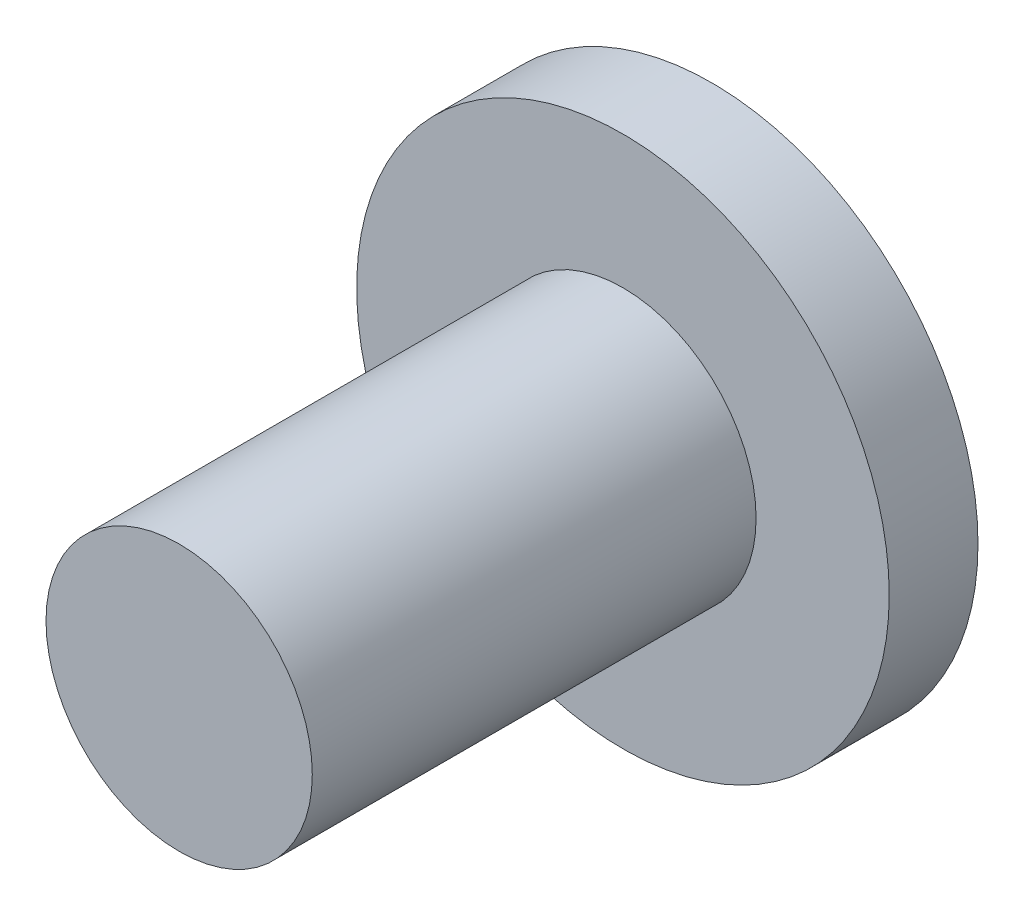
ISO-10303-21;
HEADER;
FILE_DESCRIPTION(('STEP AP214'),'2;1');
FILE_NAME('part.step','',(''),(''),'','','');
FILE_SCHEMA(('AUTOMOTIVE_DESIGN { 1 0 10303 214 1 1 1 1 }'));
ENDSEC;
DATA;
#1=APPLICATION_CONTEXT('core data for automotive mechanical design processes');
#2=APPLICATION_PROTOCOL_DEFINITION('international standard','automotive_design',2000,#1);
#3=PRODUCT_CONTEXT('',#1,'mechanical');
#4=PRODUCT('Part','Part','',(#3));
#5=PRODUCT_RELATED_PRODUCT_CATEGORY('part','',(#4));
#6=PRODUCT_DEFINITION_FORMATION('','',#4);
#7=PRODUCT_DEFINITION_CONTEXT('part definition',#1,'design');
#8=PRODUCT_DEFINITION('design','',#6,#7);
#9=PRODUCT_DEFINITION_SHAPE('','',#8);
#10=(LENGTH_UNIT() NAMED_UNIT(*) SI_UNIT(.MILLI.,.METRE.));
#11=(NAMED_UNIT(*) PLANE_ANGLE_UNIT() SI_UNIT($,.RADIAN.));
#12=(NAMED_UNIT(*) SI_UNIT($,.STERADIAN.) SOLID_ANGLE_UNIT());
#13=UNCERTAINTY_MEASURE_WITH_UNIT(LENGTH_MEASURE(1.E-05),#10,'distance_accuracy_value','');
#14=(GEOMETRIC_REPRESENTATION_CONTEXT(3) GLOBAL_UNCERTAINTY_ASSIGNED_CONTEXT((#13)) GLOBAL_UNIT_ASSIGNED_CONTEXT((#10,
#11,#12)) REPRESENTATION_CONTEXT('',''));
#15=CARTESIAN_POINT('',(0.,0.,0.));
#16=DIRECTION('',(0.,0.,1.));
#17=DIRECTION('',(1.,0.,0.));
#18=AXIS2_PLACEMENT_3D('',#15,#16,#17);
#19=CARTESIAN_POINT('',(0.,0.,2.));
#20=DIRECTION('',(0.,0.,-1.));
#21=DIRECTION('',(-1.,0.,0.));
#22=AXIS2_PLACEMENT_3D('',#19,#20,#21);
#23=CYLINDRICAL_SURFACE('',#22,6.);
#24=CARTESIAN_POINT('',(0.,0.,2.));
#25=DIRECTION('',(0.,0.,1.));
#26=DIRECTION('',(1.,0.,0.));
#27=AXIS2_PLACEMENT_3D('',#24,#25,#26);
#28=CIRCLE('',#27,6.);
#29=CARTESIAN_POINT('',(6.,0.,2.));
#30=VERTEX_POINT('',#29);
#31=EDGE_CURVE('E45',#30,#30,#28,.T.);
#32=ORIENTED_EDGE('',*,*,#31,.F.);
#33=EDGE_LOOP('',(#32));
#34=FACE_BOUND('',#33,.T.);
#35=CARTESIAN_POINT('',(0.,0.,0.));
#36=DIRECTION('',(0.,0.,1.));
#37=DIRECTION('',(1.,0.,0.));
#38=AXIS2_PLACEMENT_3D('',#35,#36,#37);
#39=CIRCLE('',#38,6.);
#40=CARTESIAN_POINT('',(6.,0.,0.));
#41=VERTEX_POINT('',#40);
#42=EDGE_CURVE('E40',#41,#41,#39,.T.);
#43=ORIENTED_EDGE('',*,*,#42,.T.);
#44=EDGE_LOOP('',(#43));
#45=FACE_BOUND('',#44,.T.);
#46=ADVANCED_FACE('F37',(#34,#45),#23,.T.);
#47=CARTESIAN_POINT('',(0.,0.,2.));
#48=DIRECTION('',(0.,0.,1.));
#49=DIRECTION('',(1.,0.,0.));
#50=AXIS2_PLACEMENT_3D('',#47,#48,#49);
#51=PLANE('',#50);
#52=CARTESIAN_POINT('',(0.,0.,2.));
#53=DIRECTION('',(0.,0.,1.));
#54=DIRECTION('',(1.,0.,0.));
#55=AXIS2_PLACEMENT_3D('',#52,#53,#54);
#56=CIRCLE('',#55,3.);
#57=CARTESIAN_POINT('',(3.,0.,2.));
#58=VERTEX_POINT('',#57);
#59=EDGE_CURVE('E10',#58,#58,#56,.T.);
#60=ORIENTED_EDGE('',*,*,#59,.F.);
#61=EDGE_LOOP('',(#60));
#62=FACE_BOUND('',#61,.T.);
#63=ORIENTED_EDGE('',*,*,#31,.T.);
#64=EDGE_LOOP('',(#63));
#65=FACE_BOUND('',#64,.T.);
#66=ADVANCED_FACE('F65',(#62,#65),#51,.T.);
#67=CARTESIAN_POINT('',(0.,0.,0.));
#68=DIRECTION('',(0.,0.,1.));
#69=DIRECTION('',(1.,0.,0.));
#70=AXIS2_PLACEMENT_3D('',#67,#68,#69);
#71=PLANE('',#70);
#72=ORIENTED_EDGE('',*,*,#42,.F.);
#73=EDGE_LOOP('',(#72));
#74=FACE_BOUND('',#73,.T.);
#75=ADVANCED_FACE('F62',(#74),#71,.F.);
#76=CARTESIAN_POINT('',(0.,0.,12.));
#77=DIRECTION('',(0.,0.,-1.));
#78=DIRECTION('',(-1.,0.,0.));
#79=AXIS2_PLACEMENT_3D('',#76,#77,#78);
#80=CYLINDRICAL_SURFACE('',#79,3.);
#81=CARTESIAN_POINT('',(0.,0.,12.));
#82=DIRECTION('',(0.,0.,1.));
#83=DIRECTION('',(1.,0.,0.));
#84=AXIS2_PLACEMENT_3D('',#81,#82,#83);
#85=CIRCLE('',#84,3.);
#86=CARTESIAN_POINT('',(3.,0.,12.));
#87=VERTEX_POINT('',#86);
#88=EDGE_CURVE('E52',#87,#87,#85,.T.);
#89=ORIENTED_EDGE('',*,*,#88,.F.);
#90=EDGE_LOOP('',(#89));
#91=FACE_BOUND('',#90,.T.);
#92=ORIENTED_EDGE('',*,*,#59,.T.);
#93=EDGE_LOOP('',(#92));
#94=FACE_BOUND('',#93,.T.);
#95=ADVANCED_FACE('F64',(#91,#94),#80,.T.);
#96=CARTESIAN_POINT('',(0.,0.,12.));
#97=DIRECTION('',(0.,0.,1.));
#98=DIRECTION('',(1.,0.,0.));
#99=AXIS2_PLACEMENT_3D('',#96,#97,#98);
#100=PLANE('',#99);
#101=ORIENTED_EDGE('',*,*,#88,.T.);
#102=EDGE_LOOP('',(#101));
#103=FACE_BOUND('',#102,.T.);
#104=ADVANCED_FACE('F70',(#103),#100,.T.);
#105=CLOSED_SHELL('',(#46,#66,#75,#95,#104));
#106=MANIFOLD_SOLID_BREP('B2',#105);
#107=ADVANCED_BREP_SHAPE_REPRESENTATION('',(#18,#106),#14);
#108=SHAPE_DEFINITION_REPRESENTATION(#9,#107);
ENDSEC;
END-ISO-10303-21;
